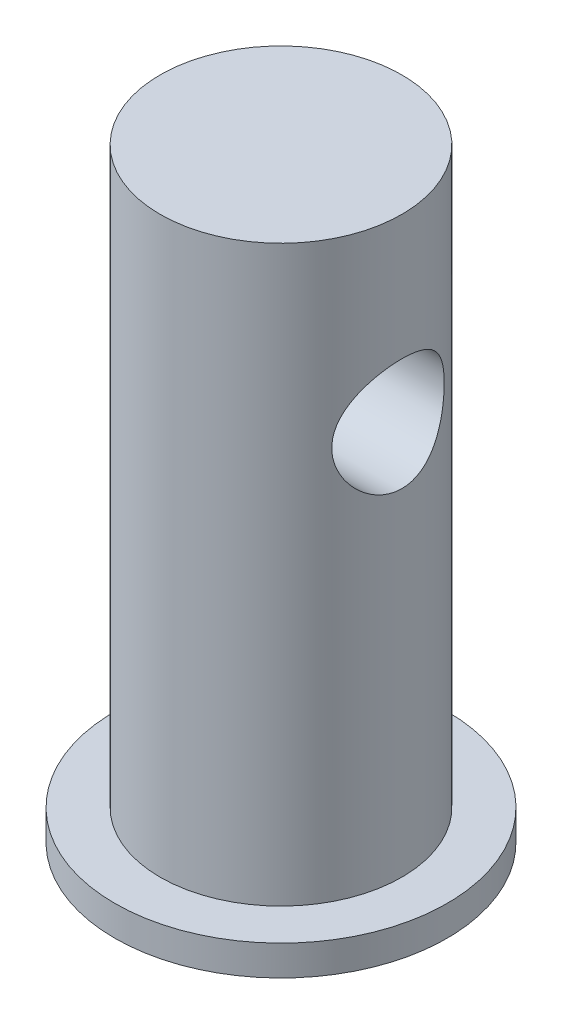
ISO-10303-21;
HEADER;
FILE_DESCRIPTION(('STEP AP214'),'2;1');
FILE_NAME('part.step','',(''),(''),'','','');
FILE_SCHEMA(('AUTOMOTIVE_DESIGN { 1 0 10303 214 1 1 1 1 }'));
ENDSEC;
DATA;
#1=APPLICATION_CONTEXT('core data for automotive mechanical design processes');
#2=APPLICATION_PROTOCOL_DEFINITION('international standard','automotive_design',2000,#1);
#3=PRODUCT_CONTEXT('',#1,'mechanical');
#4=PRODUCT('Part','Part','',(#3));
#5=PRODUCT_RELATED_PRODUCT_CATEGORY('part','',(#4));
#6=PRODUCT_DEFINITION_FORMATION('','',#4);
#7=PRODUCT_DEFINITION_CONTEXT('part definition',#1,'design');
#8=PRODUCT_DEFINITION('design','',#6,#7);
#9=PRODUCT_DEFINITION_SHAPE('','',#8);
#10=(LENGTH_UNIT() NAMED_UNIT(*) SI_UNIT(.MILLI.,.METRE.));
#11=(NAMED_UNIT(*) PLANE_ANGLE_UNIT() SI_UNIT($,.RADIAN.));
#12=(NAMED_UNIT(*) SI_UNIT($,.STERADIAN.) SOLID_ANGLE_UNIT());
#13=UNCERTAINTY_MEASURE_WITH_UNIT(LENGTH_MEASURE(1.E-05),#10,'distance_accuracy_value','');
#14=(GEOMETRIC_REPRESENTATION_CONTEXT(3) GLOBAL_UNCERTAINTY_ASSIGNED_CONTEXT((#13)) GLOBAL_UNIT_ASSIGNED_CONTEXT((#10,
#11,#12)) REPRESENTATION_CONTEXT('',''));
#15=CARTESIAN_POINT('',(0.,0.,0.));
#16=DIRECTION('',(0.,0.,1.));
#17=DIRECTION('',(1.,0.,0.));
#18=AXIS2_PLACEMENT_3D('',#15,#16,#17);
#19=CARTESIAN_POINT('',(0.,1.,0.));
#20=DIRECTION('',(0.,1.,0.));
#21=DIRECTION('',(0.,0.,1.));
#22=AXIS2_PLACEMENT_3D('',#19,#20,#21);
#23=PLANE('',#22);
#24=CARTESIAN_POINT('',(0.,1.,0.));
#25=DIRECTION('',(0.,1.,0.));
#26=DIRECTION('',(0.,0.,1.));
#27=AXIS2_PLACEMENT_3D('',#24,#25,#26);
#28=CIRCLE('',#27,5.5);
#29=CARTESIAN_POINT('',(0.,1.,5.5));
#30=VERTEX_POINT('',#29);
#31=EDGE_CURVE('E44',#30,#30,#28,.T.);
#32=ORIENTED_EDGE('',*,*,#31,.T.);
#33=EDGE_LOOP('',(#32));
#34=FACE_BOUND('',#33,.T.);
#35=CARTESIAN_POINT('',(0.,1.,0.));
#36=DIRECTION('',(0.,1.,0.));
#37=DIRECTION('',(0.,0.,1.));
#38=AXIS2_PLACEMENT_3D('',#35,#36,#37);
#39=CIRCLE('',#38,4.);
#40=CARTESIAN_POINT('',(0.,1.,4.));
#41=VERTEX_POINT('',#40);
#42=EDGE_CURVE('E82',#41,#41,#39,.T.);
#43=ORIENTED_EDGE('',*,*,#42,.F.);
#44=EDGE_LOOP('',(#43));
#45=FACE_BOUND('',#44,.T.);
#46=ADVANCED_FACE('F31',(#34,#45),#23,.T.);
#47=CARTESIAN_POINT('',(0.,0.,0.));
#48=DIRECTION('',(0.,1.,0.));
#49=DIRECTION('',(0.,0.,1.));
#50=AXIS2_PLACEMENT_3D('',#47,#48,#49);
#51=PLANE('',#50);
#52=CARTESIAN_POINT('',(0.,0.,0.));
#53=DIRECTION('',(0.,1.,0.));
#54=DIRECTION('',(0.,0.,1.));
#55=AXIS2_PLACEMENT_3D('',#52,#53,#54);
#56=CIRCLE('',#55,5.5);
#57=CARTESIAN_POINT('',(0.,0.,5.5));
#58=VERTEX_POINT('',#57);
#59=EDGE_CURVE('E48',#58,#58,#56,.T.);
#60=ORIENTED_EDGE('',*,*,#59,.F.);
#61=EDGE_LOOP('',(#60));
#62=FACE_BOUND('',#61,.T.);
#63=ADVANCED_FACE('F72',(#62),#51,.F.);
#64=CARTESIAN_POINT('',(0.,1.,0.));
#65=DIRECTION('',(0.,-1.,0.));
#66=DIRECTION('',(0.,0.,-1.));
#67=AXIS2_PLACEMENT_3D('',#64,#65,#66);
#68=CYLINDRICAL_SURFACE('',#67,5.5);
#69=ORIENTED_EDGE('',*,*,#31,.F.);
#70=EDGE_LOOP('',(#69));
#71=FACE_BOUND('',#70,.T.);
#72=ORIENTED_EDGE('',*,*,#59,.T.);
#73=EDGE_LOOP('',(#72));
#74=FACE_BOUND('',#73,.T.);
#75=ADVANCED_FACE('F33',(#71,#74),#68,.T.);
#76=CARTESIAN_POINT('',(0.,20.,0.));
#77=DIRECTION('',(0.,-1.,0.));
#78=DIRECTION('',(0.,0.,-1.));
#79=AXIS2_PLACEMENT_3D('',#76,#77,#78);
#80=CYLINDRICAL_SURFACE('',#79,4.);
#81=CARTESIAN_POINT('',(-3.54062436841604,14.,-1.86117680024722));
#82=CARTESIAN_POINT('',(-3.54063087645332,14.0979876085554,-1.86117115387495));
#83=CARTESIAN_POINT('',(-3.54475223799218,14.1961215514401,-1.85338827527874));
#84=CARTESIAN_POINT('',(-3.5606672421835,14.3894572858473,-1.82261688391071));
#85=CARTESIAN_POINT('',(-3.5724791616905,14.4846515251333,-1.79959214619164));
#86=CARTESIAN_POINT('',(-3.6021215067444,14.6689563633874,-1.73949041566868));
#87=CARTESIAN_POINT('',(-3.61992321179216,14.7580935986474,-1.70248037885414));
#88=CARTESIAN_POINT('',(-3.65949552302958,14.9288721450299,-1.61566110484681));
#89=CARTESIAN_POINT('',(-3.68126585975394,15.0105139645166,-1.56585273655131));
#90=CARTESIAN_POINT('',(-3.72821682254294,15.1703982566903,-1.4506988538906));
#91=CARTESIAN_POINT('',(-3.75352981055557,15.2479889566951,-1.3845019288103));
#92=CARTESIAN_POINT('',(-3.80363840236125,15.3914632080884,-1.24022826705802));
#93=CARTESIAN_POINT('',(-3.82843377145523,15.4573415464167,-1.16214626901014));
#94=CARTESIAN_POINT('',(-3.87639150248624,15.5791463518076,-0.99091896920961));
#95=CARTESIAN_POINT('',(-3.89938258269732,15.6343007722832,-0.897172039794234));
#96=CARTESIAN_POINT('',(-3.93946707638104,15.727764113401,-0.700462477521085));
#97=CARTESIAN_POINT('',(-3.956563723755,15.7660822742077,-0.59750493711926));
#98=CARTESIAN_POINT('',(-3.98198630083102,15.8223011491836,-0.392176196295732));
#99=CARTESIAN_POINT('',(-3.99079707740834,15.8413364270191,-0.29017697253822));
#100=CARTESIAN_POINT('',(-4.00044390301928,15.862154996969,-0.0840791074366153));
#101=CARTESIAN_POINT('',(-4.00128405620363,15.863947167732,0.0200184257922511));
#102=CARTESIAN_POINT('',(-3.9951495638116,15.8507356614858,0.218952748032272));
#103=CARTESIAN_POINT('',(-3.98876057929269,15.83699078554,0.313894977348502));
#104=CARTESIAN_POINT('',(-3.96973589204067,15.7953063403255,0.499944022061698));
#105=CARTESIAN_POINT('',(-3.95709972548322,15.7673657170842,0.591050552130658));
#106=CARTESIAN_POINT('',(-3.9265276742109,15.6978178892953,0.768515943552523));
#107=CARTESIAN_POINT('',(-3.90851541390437,15.6560126949194,0.854783511746091));
#108=CARTESIAN_POINT('',(-3.86887511754065,15.560152693208,1.0193020064732));
#109=CARTESIAN_POINT('',(-3.84724575624289,15.5060933935993,1.09754997776171));
#110=CARTESIAN_POINT('',(-3.80030255180872,15.3819739787146,1.25086379760557));
#111=CARTESIAN_POINT('',(-3.77483180509712,15.3109467551967,1.32509956550556));
#112=CARTESIAN_POINT('',(-3.72433806607385,15.1575477396589,1.46101803156193));
#113=CARTESIAN_POINT('',(-3.69931534724708,15.075169268618,1.52269328583497));
#114=CARTESIAN_POINT('',(-3.65126919642278,14.8963847397599,1.63466574883739));
#115=CARTESIAN_POINT('',(-3.62840466723766,14.7994879772253,1.68425399355422));
#116=CARTESIAN_POINT('',(-3.58930604181759,14.5973886380419,1.76605788991133));
#117=CARTESIAN_POINT('',(-3.57306589499374,14.4921937460527,1.79828940352642));
#118=CARTESIAN_POINT('',(-3.55067853078827,14.2847978987391,1.84207703884484));
#119=CARTESIAN_POINT('',(-3.54386938384561,14.1829579897582,1.8549948804998));
#120=CARTESIAN_POINT('',(-3.53921660215391,13.9783598174016,1.86386151707174));
#121=CARTESIAN_POINT('',(-3.54136832352329,13.8756020572395,1.85981910146662));
#122=CARTESIAN_POINT('',(-3.55369882274267,13.6817160844369,1.83612834324846));
#123=CARTESIAN_POINT('',(-3.5631515242489,13.590362569852,1.8178905132874));
#124=CARTESIAN_POINT('',(-3.58800818190028,13.4121398273219,1.76832125708734));
#125=CARTESIAN_POINT('',(-3.60341378719302,13.3252718495824,1.7369862022953));
#126=CARTESIAN_POINT('',(-3.63928698085872,13.1539894811515,1.66055531381658));
#127=CARTESIAN_POINT('',(-3.65995454022439,13.0698709607817,1.61489363075748));
#128=CARTESIAN_POINT('',(-3.70379978268443,12.910031500454,1.51162556309178));
#129=CARTESIAN_POINT('',(-3.72697869979969,12.8343147262385,1.45401329342216));
#130=CARTESIAN_POINT('',(-3.77619490028693,12.6850438777474,1.3213127939681));
#131=CARTESIAN_POINT('',(-3.80227463775746,12.6125706396652,1.24501920242931));
#132=CARTESIAN_POINT('',(-3.85216038539724,12.4811788806893,1.08084074101999));
#133=CARTESIAN_POINT('',(-3.87596592829915,12.4222631418987,0.992953497854039));
#134=CARTESIAN_POINT('',(-3.91910121372643,12.3190578878449,0.806193444045009));
#135=CARTESIAN_POINT('',(-3.9383623167677,12.2749888399291,0.707181894017508));
#136=CARTESIAN_POINT('',(-3.96972666203092,12.2045299990757,0.502003267390456));
#137=CARTESIAN_POINT('',(-3.98183532565911,12.1781268137471,0.395841678552258));
#138=CARTESIAN_POINT('',(-3.9967703407205,12.145724776232,0.188906668914271));
#139=CARTESIAN_POINT('',(-4.00028463945445,12.138212202724,0.0884189473540567));
#140=CARTESIAN_POINT('',(-3.99967937421669,12.1395115386317,-0.112414474510417));
#141=CARTESIAN_POINT('',(-3.99556181862731,12.1483191532616,-0.212760205226373));
#142=CARTESIAN_POINT('',(-3.98055044565916,12.1809473298518,-0.405024238857376));
#143=CARTESIAN_POINT('',(-3.97001917436931,12.2039655106971,-0.497109697220177));
#144=CARTESIAN_POINT('',(-3.94349984713282,12.2633726558106,-0.676012930185096));
#145=CARTESIAN_POINT('',(-3.92751089986049,12.2997638041726,-0.762829841619878));
#146=CARTESIAN_POINT('',(-3.89065892799722,12.3866733530905,-0.933117065753664));
#147=CARTESIAN_POINT('',(-3.86960753586111,12.4377582500935,-1.0162563673527));
#148=CARTESIAN_POINT('',(-3.82496932424961,12.5518548345448,-1.17314696572849));
#149=CARTESIAN_POINT('',(-3.80138136969184,12.6148718711644,-1.24689402707264));
#150=CARTESIAN_POINT('',(-3.75168720605745,12.7574310379626,-1.3896177896883));
#151=CARTESIAN_POINT('',(-3.72554011691409,12.8379327151269,-1.45762493927681));
#152=CARTESIAN_POINT('',(-3.67556078719551,13.0098101206384,-1.57943044788183));
#153=CARTESIAN_POINT('',(-3.65173017988361,13.1011934216375,-1.63321882707325));
#154=CARTESIAN_POINT('',(-3.60908063054707,13.2940352215332,-1.72544565228426));
#155=CARTESIAN_POINT('',(-3.59032968381265,13.3956076303037,-1.76367898033237));
#156=CARTESIAN_POINT('',(-3.56112328853354,13.6047941437338,-1.82194790496644));
#157=CARTESIAN_POINT('',(-3.55064000432017,13.7123866579118,-1.84204459747535));
#158=CARTESIAN_POINT('',(-3.54364425144099,13.8506948777364,-1.85542100409778));
#159=CARTESIAN_POINT('',(-3.54251468733665,13.8804991983502,-1.85757692729098));
#160=CARTESIAN_POINT('',(-3.54100373584896,13.9401977991519,-1.86045571920107));
#161=CARTESIAN_POINT('',(-3.54062238202369,13.9700920833146,-1.86117852364096));
#162=CARTESIAN_POINT('',(-3.54062436841604,14.,-1.86117680024722));
#163=B_SPLINE_CURVE_WITH_KNOTS('',3,(#81,#82,#83,#84,#85,#86,#87,#88,#89,#90,#91,#92,#93,#94,
#95,#96,#97,#98,#99,#100,#101,#102,#103,#104,#105,#106,#107,#108,#109,#110,#111,#112,#113,#114,
#115,#116,#117,#118,#119,#120,#121,#122,#123,#124,#125,#126,#127,#128,#129,#130,#131,#132,#133,
#134,#135,#136,#137,#138,#139,#140,#141,#142,#143,#144,#145,#146,#147,#148,#149,#150,#151,#152,
#153,#154,#155,#156,#157,#158,#159,#160,#161,#162),.UNSPECIFIED.,.T.,.F.,(4,2,2,2,2,2,2,2,2,2,2,
2,2,2,2,2,2,2,2,2,2,2,2,2,2,2,2,2,2,2,2,2,2,2,2,2,2,2,2,2,4),(0.,0.293837113766317,
0.588375102283563,0.881520469107794,1.17464593912395,1.4885610713784,1.80261557635767,
2.1344045145888,2.46601113052593,2.77671909899255,3.08726707224572,3.37435118941981,
3.6614566244616,3.95285247865438,4.24435532987949,4.56053422644937,4.87689996198526,
5.20882854494376,5.54045326787908,5.84736576009402,6.15411921773628,6.43376771762409,
6.71349374482977,7.00606553547064,7.29878174651473,7.62253931341172,7.94636325872121,
8.27480328571096,8.60299404119545,8.9039028959794,9.20473257547948,9.48995892447498,
9.77523187779598,10.0734595754778,10.3718212863621,10.6960783550237,11.0205624115264,
11.3491964911214,11.6767193408399,11.7664006987126,11.8560860788045),.UNSPECIFIED.);
#164=CARTESIAN_POINT('',(-3.54062436841604,14.,-1.86117680024722));
#165=VERTEX_POINT('',#164);
#166=EDGE_CURVE('E35',#165,#165,#163,.T.);
#167=ORIENTED_EDGE('',*,*,#166,.T.);
#168=EDGE_LOOP('',(#167));
#169=FACE_BOUND('',#168,.T.);
#170=CARTESIAN_POINT('',(3.54062436841604,14.,-1.86117680024722));
#171=CARTESIAN_POINT('',(3.54063087645332,13.9020123914446,-1.86117115387495));
#172=CARTESIAN_POINT('',(3.54475223799218,13.8038784485599,-1.85338827527874));
#173=CARTESIAN_POINT('',(3.5606672421835,13.6105427141527,-1.82261688391071));
#174=CARTESIAN_POINT('',(3.5724791616905,13.5153484748667,-1.79959214619164));
#175=CARTESIAN_POINT('',(3.6021215067444,13.3310436366126,-1.73949041566868));
#176=CARTESIAN_POINT('',(3.61992321179216,13.2419064013526,-1.70248037885414));
#177=CARTESIAN_POINT('',(3.65949552302958,13.07112785497,-1.61566110484681));
#178=CARTESIAN_POINT('',(3.68126585975394,12.9894860354834,-1.56585273655131));
#179=CARTESIAN_POINT('',(3.72821682254294,12.8296017433097,-1.4506988538906));
#180=CARTESIAN_POINT('',(3.75352981055557,12.7520110433049,-1.38450192881031));
#181=CARTESIAN_POINT('',(3.80363840236125,12.6085367919116,-1.24022826705803));
#182=CARTESIAN_POINT('',(3.82843377145523,12.5426584535833,-1.16214626901014));
#183=CARTESIAN_POINT('',(3.87639150248624,12.4208536481924,-0.99091896920961));
#184=CARTESIAN_POINT('',(3.89938258269732,12.3656992277168,-0.897172039794235));
#185=CARTESIAN_POINT('',(3.93946707638104,12.272235886599,-0.700462477521086));
#186=CARTESIAN_POINT('',(3.956563723755,12.2339177257923,-0.597504937119261));
#187=CARTESIAN_POINT('',(3.98198630083102,12.1776988508164,-0.392176196295733));
#188=CARTESIAN_POINT('',(3.99079707740834,12.1586635729809,-0.290176972538221));
#189=CARTESIAN_POINT('',(4.00044390301928,12.137845003031,-0.084079107436615));
#190=CARTESIAN_POINT('',(4.00128405620363,12.1360528322679,0.0200184257922514));
#191=CARTESIAN_POINT('',(3.9951495638116,12.1492643385142,0.218952748032273));
#192=CARTESIAN_POINT('',(3.98876057929269,12.16300921446,0.313894977348502));
#193=CARTESIAN_POINT('',(3.96973589204067,12.2046936596745,0.499944022061698));
#194=CARTESIAN_POINT('',(3.95709972548322,12.2326342829158,0.591050552130658));
#195=CARTESIAN_POINT('',(3.9265276742109,12.3021821107047,0.768515943552523));
#196=CARTESIAN_POINT('',(3.90851541390437,12.3439873050806,0.854783511746093));
#197=CARTESIAN_POINT('',(3.86887511754065,12.439847306792,1.0193020064732));
#198=CARTESIAN_POINT('',(3.84724575624289,12.4939066064007,1.09754997776171));
#199=CARTESIAN_POINT('',(3.80030255180872,12.6180260212854,1.25086379760557));
#200=CARTESIAN_POINT('',(3.77483180509712,12.6890532448033,1.32509956550556));
#201=CARTESIAN_POINT('',(3.72433806607385,12.8424522603411,1.46101803156193));
#202=CARTESIAN_POINT('',(3.69931534724708,12.924830731382,1.52269328583497));
#203=CARTESIAN_POINT('',(3.65126919642278,13.1036152602401,1.63466574883739));
#204=CARTESIAN_POINT('',(3.62840466723766,13.2005120227747,1.68425399355422));
#205=CARTESIAN_POINT('',(3.58930604181759,13.4026113619581,1.76605788991133));
#206=CARTESIAN_POINT('',(3.57306589499374,13.5078062539473,1.79828940352642));
#207=CARTESIAN_POINT('',(3.55067853078827,13.7152021012609,1.84207703884484));
#208=CARTESIAN_POINT('',(3.54386938384561,13.8170420102418,1.8549948804998));
#209=CARTESIAN_POINT('',(3.53921660215391,14.0216401825984,1.86386151707174));
#210=CARTESIAN_POINT('',(3.54136832352329,14.1243979427605,1.85981910146662));
#211=CARTESIAN_POINT('',(3.55369882274267,14.3182839155631,1.83612834324846));
#212=CARTESIAN_POINT('',(3.5631515242489,14.409637430148,1.8178905132874));
#213=CARTESIAN_POINT('',(3.58800818190028,14.5878601726781,1.76832125708734));
#214=CARTESIAN_POINT('',(3.60341378719302,14.6747281504176,1.7369862022953));
#215=CARTESIAN_POINT('',(3.63928698085872,14.8460105188485,1.66055531381658));
#216=CARTESIAN_POINT('',(3.65995454022439,14.9301290392183,1.61489363075748));
#217=CARTESIAN_POINT('',(3.70379978268443,15.089968499546,1.51162556309178));
#218=CARTESIAN_POINT('',(3.72697869979969,15.1656852737615,1.45401329342216));
#219=CARTESIAN_POINT('',(3.77619490028693,15.3149561222526,1.3213127939681));
#220=CARTESIAN_POINT('',(3.80227463775746,15.3874293603348,1.24501920242931));
#221=CARTESIAN_POINT('',(3.85216038539723,15.5188211193107,1.08084074102));
#222=CARTESIAN_POINT('',(3.87596592829915,15.5777368581013,0.992953497854041));
#223=CARTESIAN_POINT('',(3.91910121372643,15.6809421121551,0.80619344404501));
#224=CARTESIAN_POINT('',(3.9383623167677,15.7250111600709,0.707181894017509));
#225=CARTESIAN_POINT('',(3.96972666203092,15.7954700009243,0.502003267390456));
#226=CARTESIAN_POINT('',(3.98183532565911,15.8218731862529,0.395841678552258));
#227=CARTESIAN_POINT('',(3.9967703407205,15.854275223768,0.188906668914271));
#228=CARTESIAN_POINT('',(4.00028463945445,15.861787797276,0.0884189473540572));
#229=CARTESIAN_POINT('',(3.99967937421669,15.8604884613683,-0.112414474510416));
#230=CARTESIAN_POINT('',(3.99556181862731,15.8516808467384,-0.212760205226373));
#231=CARTESIAN_POINT('',(3.98055044565916,15.8190526701482,-0.405024238857376));
#232=CARTESIAN_POINT('',(3.97001917436931,15.7960344893029,-0.497109697220177));
#233=CARTESIAN_POINT('',(3.94349984713282,15.7366273441894,-0.676012930185096));
#234=CARTESIAN_POINT('',(3.92751089986049,15.7002361958274,-0.762829841619878));
#235=CARTESIAN_POINT('',(3.89065892799722,15.6133266469095,-0.933117065753665));
#236=CARTESIAN_POINT('',(3.86960753586111,15.5622417499065,-1.0162563673527));
#237=CARTESIAN_POINT('',(3.82496932424961,15.4481451654552,-1.17314696572849));
#238=CARTESIAN_POINT('',(3.80138136969184,15.3851281288356,-1.24689402707264));
#239=CARTESIAN_POINT('',(3.75168720605745,15.2425689620374,-1.3896177896883));
#240=CARTESIAN_POINT('',(3.72554011691409,15.1620672848731,-1.45762493927681));
#241=CARTESIAN_POINT('',(3.67556078719551,14.9901898793616,-1.57943044788183));
#242=CARTESIAN_POINT('',(3.65173017988361,14.8988065783625,-1.63321882707325));
#243=CARTESIAN_POINT('',(3.60908063054707,14.7059647784668,-1.72544565228426));
#244=CARTESIAN_POINT('',(3.59032968381265,14.6043923696963,-1.76367898033237));
#245=CARTESIAN_POINT('',(3.56112328853354,14.3952058562662,-1.82194790496644));
#246=CARTESIAN_POINT('',(3.55064000432017,14.2876133420882,-1.84204459747534));
#247=CARTESIAN_POINT('',(3.54364425144099,14.1493051222636,-1.85542100409778));
#248=CARTESIAN_POINT('',(3.54251468733665,14.1195008016498,-1.85757692729098));
#249=CARTESIAN_POINT('',(3.54100373584896,14.0598022008481,-1.86045571920107));
#250=CARTESIAN_POINT('',(3.54062238202369,14.0299079166854,-1.86117852364096));
#251=CARTESIAN_POINT('',(3.54062436841604,14.,-1.86117680024722));
#252=B_SPLINE_CURVE_WITH_KNOTS('',3,(#170,#171,#172,#173,#174,#175,#176,#177,#178,#179,#180,
#181,#182,#183,#184,#185,#186,#187,#188,#189,#190,#191,#192,#193,#194,#195,#196,#197,#198,#199,
#200,#201,#202,#203,#204,#205,#206,#207,#208,#209,#210,#211,#212,#213,#214,#215,#216,#217,#218,
#219,#220,#221,#222,#223,#224,#225,#226,#227,#228,#229,#230,#231,#232,#233,#234,#235,#236,#237,
#238,#239,#240,#241,#242,#243,#244,#245,#246,#247,#248,#249,#250,#251),.UNSPECIFIED.,.T.,.F.,(4,
2,2,2,2,2,2,2,2,2,2,2,2,2,2,2,2,2,2,2,2,2,2,2,2,2,2,2,2,2,2,2,2,2,2,2,2,2,2,2,4),(0.,
0.293837113766317,0.588375102283563,0.881520469107794,1.17464593912395,1.48856107137839,
1.80261557635767,2.1344045145888,2.46601113052593,2.77671909899255,3.08726707224572,
3.37435118941981,3.6614566244616,3.95285247865438,4.24435532987949,4.56053422644937,
4.87689996198526,5.20882854494376,5.54045326787909,5.84736576009402,6.15411921773627,
6.43376771762409,6.71349374482977,7.00606553547064,7.29878174651473,7.62253931341172,
7.94636325872121,8.27480328571096,8.60299404119545,8.9039028959794,9.20473257547948,
9.48995892447498,9.77523187779598,10.0734595754778,10.3718212863622,10.6960783550237,
11.0205624115264,11.3491964911214,11.6767193408399,11.7664006987126,11.8560860788045),.UNSPECIFIED.);
#253=CARTESIAN_POINT('',(3.54062436841604,14.,-1.86117680024722));
#254=VERTEX_POINT('',#253);
#255=EDGE_CURVE('E10',#254,#254,#252,.T.);
#256=ORIENTED_EDGE('',*,*,#255,.T.);
#257=EDGE_LOOP('',(#256));
#258=FACE_BOUND('',#257,.T.);
#259=ORIENTED_EDGE('',*,*,#42,.T.);
#260=EDGE_LOOP('',(#259));
#261=FACE_BOUND('',#260,.T.);
#262=CARTESIAN_POINT('',(0.,20.,0.));
#263=DIRECTION('',(0.,1.,0.));
#264=DIRECTION('',(0.,0.,1.));
#265=AXIS2_PLACEMENT_3D('',#262,#263,#264);
#266=CIRCLE('',#265,4.);
#267=CARTESIAN_POINT('',(0.,20.,4.));
#268=VERTEX_POINT('',#267);
#269=EDGE_CURVE('E84',#268,#268,#266,.T.);
#270=ORIENTED_EDGE('',*,*,#269,.F.);
#271=EDGE_LOOP('',(#270));
#272=FACE_BOUND('',#271,.T.);
#273=ADVANCED_FACE('F54',(#169,#258,#261,#272),#80,.T.);
#274=CARTESIAN_POINT('',(0.,20.,0.));
#275=DIRECTION('',(0.,1.,0.));
#276=DIRECTION('',(0.,0.,1.));
#277=AXIS2_PLACEMENT_3D('',#274,#275,#276);
#278=PLANE('',#277);
#279=ORIENTED_EDGE('',*,*,#269,.T.);
#280=EDGE_LOOP('',(#279));
#281=FACE_BOUND('',#280,.T.);
#282=ADVANCED_FACE('F61',(#281),#278,.T.);
#283=CARTESIAN_POINT('',(-8.,14.,0.));
#284=DIRECTION('',(1.,0.,0.));
#285=DIRECTION('',(0.,0.,-1.));
#286=AXIS2_PLACEMENT_3D('',#283,#284,#285);
#287=CYLINDRICAL_SURFACE('',#286,1.86117680024722);
#288=ORIENTED_EDGE('',*,*,#255,.F.);
#289=EDGE_LOOP('',(#288));
#290=FACE_BOUND('',#289,.T.);
#291=ORIENTED_EDGE('',*,*,#166,.F.);
#292=EDGE_LOOP('',(#291));
#293=FACE_BOUND('',#292,.T.);
#294=ADVANCED_FACE('F58',(#290,#293),#287,.F.);
#295=CLOSED_SHELL('',(#46,#63,#75,#273,#282,#294));
#296=MANIFOLD_SOLID_BREP('B2',#295);
#297=ADVANCED_BREP_SHAPE_REPRESENTATION('',(#18,#296),#14);
#298=SHAPE_DEFINITION_REPRESENTATION(#9,#297);
ENDSEC;
END-ISO-10303-21;
